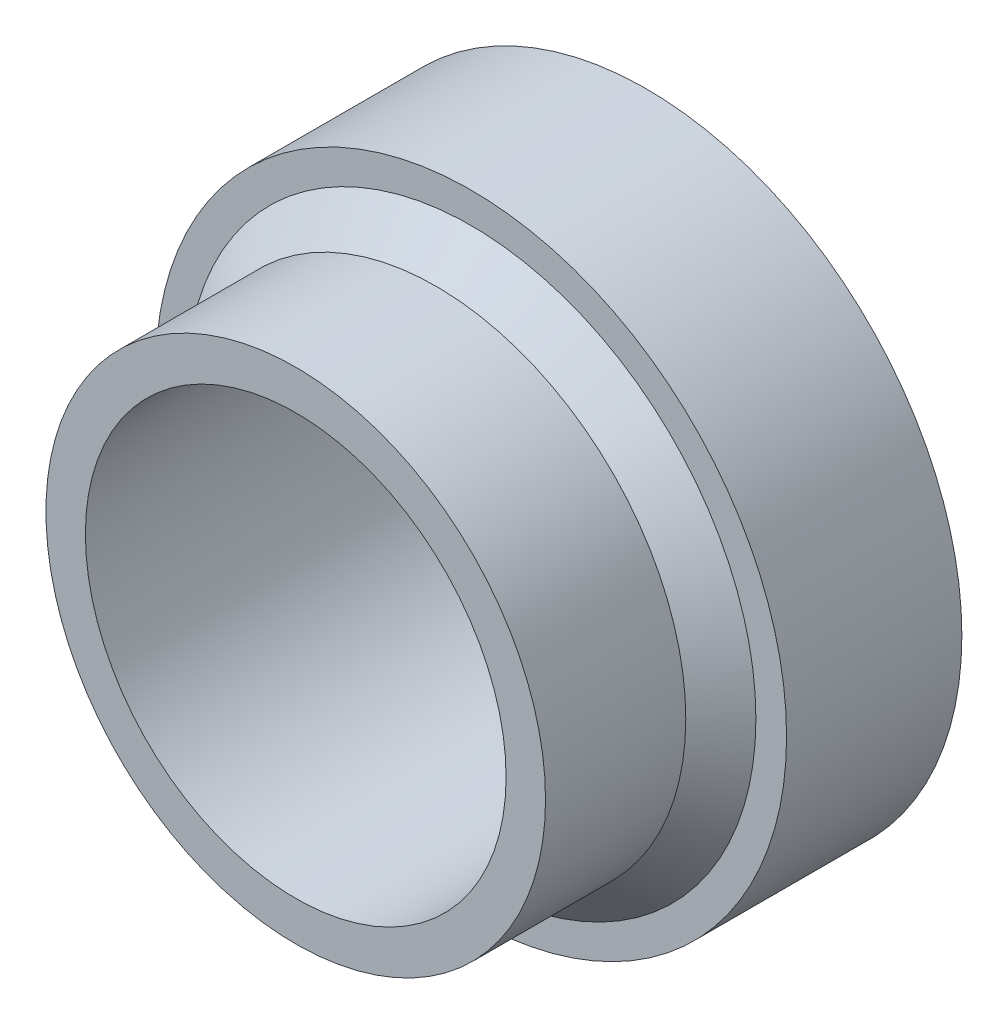
ISO-10303-21;
HEADER;
FILE_DESCRIPTION(('STEP AP214'),'2;1');
FILE_NAME('part.step','',(''),(''),'','','');
FILE_SCHEMA(('AUTOMOTIVE_DESIGN { 1 0 10303 214 1 1 1 1 }'));
ENDSEC;
DATA;
#1=APPLICATION_CONTEXT('core data for automotive mechanical design processes');
#2=APPLICATION_PROTOCOL_DEFINITION('international standard','automotive_design',2000,#1);
#3=PRODUCT_CONTEXT('',#1,'mechanical');
#4=PRODUCT('Part','Part','',(#3));
#5=PRODUCT_RELATED_PRODUCT_CATEGORY('part','',(#4));
#6=PRODUCT_DEFINITION_FORMATION('','',#4);
#7=PRODUCT_DEFINITION_CONTEXT('part definition',#1,'design');
#8=PRODUCT_DEFINITION('design','',#6,#7);
#9=PRODUCT_DEFINITION_SHAPE('','',#8);
#10=(LENGTH_UNIT() NAMED_UNIT(*) SI_UNIT(.MILLI.,.METRE.));
#11=(NAMED_UNIT(*) PLANE_ANGLE_UNIT() SI_UNIT($,.RADIAN.));
#12=(NAMED_UNIT(*) SI_UNIT($,.STERADIAN.) SOLID_ANGLE_UNIT());
#13=UNCERTAINTY_MEASURE_WITH_UNIT(LENGTH_MEASURE(1.E-05),#10,'distance_accuracy_value','');
#14=(GEOMETRIC_REPRESENTATION_CONTEXT(3) GLOBAL_UNCERTAINTY_ASSIGNED_CONTEXT((#13)) GLOBAL_UNIT_ASSIGNED_CONTEXT((#10,
#11,#12)) REPRESENTATION_CONTEXT('',''));
#15=CARTESIAN_POINT('',(0.,0.,0.));
#16=DIRECTION('',(0.,0.,1.));
#17=DIRECTION('',(1.,0.,0.));
#18=AXIS2_PLACEMENT_3D('',#15,#16,#17);
#19=CARTESIAN_POINT('',(0.,0.,10.));
#20=DIRECTION('',(0.,0.,1.));
#21=DIRECTION('',(1.,0.,0.));
#22=AXIS2_PLACEMENT_3D('',#19,#20,#21);
#23=PLANE('',#22);
#24=CARTESIAN_POINT('',(0.,0.,10.));
#25=DIRECTION('',(0.,0.,1.));
#26=DIRECTION('',(1.,0.,0.));
#27=AXIS2_PLACEMENT_3D('',#24,#25,#26);
#28=CIRCLE('',#27,16.25);
#29=CARTESIAN_POINT('',(16.25,0.,10.));
#30=VERTEX_POINT('',#29);
#31=EDGE_CURVE('E10',#30,#30,#28,.F.);
#32=ORIENTED_EDGE('',*,*,#31,.T.);
#33=EDGE_LOOP('',(#32));
#34=FACE_BOUND('',#33,.T.);
#35=CARTESIAN_POINT('',(0.,0.,10.));
#36=DIRECTION('',(0.,0.,1.));
#37=DIRECTION('',(1.,0.,0.));
#38=AXIS2_PLACEMENT_3D('',#35,#36,#37);
#39=CIRCLE('',#38,18.);
#40=CARTESIAN_POINT('',(18.,0.,10.));
#41=VERTEX_POINT('',#40);
#42=EDGE_CURVE('E44',#41,#41,#39,.T.);
#43=ORIENTED_EDGE('',*,*,#42,.T.);
#44=EDGE_LOOP('',(#43));
#45=FACE_BOUND('',#44,.T.);
#46=ADVANCED_FACE('F33',(#34,#45),#23,.T.);
#47=CARTESIAN_POINT('',(0.,0.,0.));
#48=DIRECTION('',(0.,0.,1.));
#49=DIRECTION('',(1.,0.,0.));
#50=AXIS2_PLACEMENT_3D('',#47,#48,#49);
#51=PLANE('',#50);
#52=CARTESIAN_POINT('',(0.,0.,0.));
#53=DIRECTION('',(0.,0.,1.));
#54=DIRECTION('',(1.,0.,0.));
#55=AXIS2_PLACEMENT_3D('',#52,#53,#54);
#56=CIRCLE('',#55,18.);
#57=CARTESIAN_POINT('',(18.,0.,0.));
#58=VERTEX_POINT('',#57);
#59=EDGE_CURVE('E48',#58,#58,#56,.T.);
#60=ORIENTED_EDGE('',*,*,#59,.F.);
#61=EDGE_LOOP('',(#60));
#62=FACE_BOUND('',#61,.T.);
#63=CARTESIAN_POINT('',(0.,0.,0.));
#64=DIRECTION('',(0.,0.,1.));
#65=DIRECTION('',(1.,0.,0.));
#66=AXIS2_PLACEMENT_3D('',#63,#64,#65);
#67=CIRCLE('',#66,14.2);
#68=CARTESIAN_POINT('',(14.2,0.,0.));
#69=VERTEX_POINT('',#68);
#70=EDGE_CURVE('E57',#69,#69,#67,.T.);
#71=ORIENTED_EDGE('',*,*,#70,.T.);
#72=EDGE_LOOP('',(#71));
#73=FACE_BOUND('',#72,.T.);
#74=ADVANCED_FACE('F86',(#62,#73),#51,.F.);
#75=CARTESIAN_POINT('',(0.,0.,10.));
#76=DIRECTION('',(0.,0.,-1.));
#77=DIRECTION('',(-1.,0.,0.));
#78=AXIS2_PLACEMENT_3D('',#75,#76,#77);
#79=CYLINDRICAL_SURFACE('',#78,18.);
#80=ORIENTED_EDGE('',*,*,#42,.F.);
#81=EDGE_LOOP('',(#80));
#82=FACE_BOUND('',#81,.T.);
#83=ORIENTED_EDGE('',*,*,#59,.T.);
#84=EDGE_LOOP('',(#83));
#85=FACE_BOUND('',#84,.T.);
#86=ADVANCED_FACE('F91',(#82,#85),#79,.T.);
#87=CARTESIAN_POINT('',(0.,0.,10.));
#88=DIRECTION('',(0.,0.,-1.));
#89=DIRECTION('',(-1.,0.,0.));
#90=AXIS2_PLACEMENT_3D('',#87,#88,#89);
#91=CYLINDRICAL_SURFACE('',#90,12.);
#92=CARTESIAN_POINT('',(0.,0.,1.75));
#93=DIRECTION('',(0.,0.,1.));
#94=DIRECTION('',(1.,0.,0.));
#95=AXIS2_PLACEMENT_3D('',#92,#93,#94);
#96=CIRCLE('',#95,12.);
#97=CARTESIAN_POINT('',(12.,0.,1.75));
#98=VERTEX_POINT('',#97);
#99=EDGE_CURVE('E51',#98,#98,#96,.T.);
#100=ORIENTED_EDGE('',*,*,#99,.F.);
#101=EDGE_LOOP('',(#100));
#102=FACE_BOUND('',#101,.T.);
#103=CARTESIAN_POINT('',(0.,0.,20.));
#104=DIRECTION('',(0.,0.,1.));
#105=DIRECTION('',(1.,0.,0.));
#106=AXIS2_PLACEMENT_3D('',#103,#104,#105);
#107=CIRCLE('',#106,12.);
#108=CARTESIAN_POINT('',(12.,0.,20.));
#109=VERTEX_POINT('',#108);
#110=EDGE_CURVE('E65',#109,#109,#107,.T.);
#111=ORIENTED_EDGE('',*,*,#110,.T.);
#112=EDGE_LOOP('',(#111));
#113=FACE_BOUND('',#112,.T.);
#114=ADVANCED_FACE('F69',(#102,#113),#91,.F.);
#115=CARTESIAN_POINT('',(0.,0.,1.75));
#116=DIRECTION('',(0.,0.,-1.));
#117=DIRECTION('',(-1.,0.,0.));
#118=AXIS2_PLACEMENT_3D('',#115,#116,#117);
#119=CYLINDRICAL_SURFACE('',#118,14.2);
#120=CARTESIAN_POINT('',(0.,0.,1.75));
#121=DIRECTION('',(0.,0.,1.));
#122=DIRECTION('',(1.,0.,0.));
#123=AXIS2_PLACEMENT_3D('',#120,#121,#122);
#124=CIRCLE('',#123,14.2);
#125=CARTESIAN_POINT('',(14.2,0.,1.75));
#126=VERTEX_POINT('',#125);
#127=EDGE_CURVE('E54',#126,#126,#124,.T.);
#128=ORIENTED_EDGE('',*,*,#127,.T.);
#129=EDGE_LOOP('',(#128));
#130=FACE_BOUND('',#129,.T.);
#131=ORIENTED_EDGE('',*,*,#70,.F.);
#132=EDGE_LOOP('',(#131));
#133=FACE_BOUND('',#132,.T.);
#134=ADVANCED_FACE('F82',(#130,#133),#119,.F.);
#135=CARTESIAN_POINT('',(0.,0.,1.75));
#136=DIRECTION('',(0.,0.,1.));
#137=DIRECTION('',(1.,0.,0.));
#138=AXIS2_PLACEMENT_3D('',#135,#136,#137);
#139=PLANE('',#138);
#140=ORIENTED_EDGE('',*,*,#99,.T.);
#141=EDGE_LOOP('',(#140));
#142=FACE_BOUND('',#141,.T.);
#143=ORIENTED_EDGE('',*,*,#127,.F.);
#144=EDGE_LOOP('',(#143));
#145=FACE_BOUND('',#144,.T.);
#146=ADVANCED_FACE('F74',(#142,#145),#139,.F.);
#147=CARTESIAN_POINT('',(0.,0.,20.));
#148=DIRECTION('',(0.,0.,1.));
#149=DIRECTION('',(1.,0.,0.));
#150=AXIS2_PLACEMENT_3D('',#147,#148,#149);
#151=PLANE('',#150);
#152=CARTESIAN_POINT('',(0.,0.,20.));
#153=DIRECTION('',(0.,0.,1.));
#154=DIRECTION('',(1.,0.,0.));
#155=AXIS2_PLACEMENT_3D('',#152,#153,#154);
#156=CIRCLE('',#155,14.25);
#157=CARTESIAN_POINT('',(14.25,0.,20.));
#158=VERTEX_POINT('',#157);
#159=EDGE_CURVE('E60',#158,#158,#156,.T.);
#160=ORIENTED_EDGE('',*,*,#159,.T.);
#161=EDGE_LOOP('',(#160));
#162=FACE_BOUND('',#161,.T.);
#163=ORIENTED_EDGE('',*,*,#110,.F.);
#164=EDGE_LOOP('',(#163));
#165=FACE_BOUND('',#164,.T.);
#166=ADVANCED_FACE('F71',(#162,#165),#151,.T.);
#167=CARTESIAN_POINT('',(0.,0.,20.));
#168=DIRECTION('',(0.,0.,-1.));
#169=DIRECTION('',(-1.,0.,0.));
#170=AXIS2_PLACEMENT_3D('',#167,#168,#169);
#171=CYLINDRICAL_SURFACE('',#170,14.25);
#172=CARTESIAN_POINT('',(0.,0.,12.));
#173=DIRECTION('',(0.,0.,1.));
#174=DIRECTION('',(1.,0.,0.));
#175=AXIS2_PLACEMENT_3D('',#172,#173,#174);
#176=CIRCLE('',#175,14.25);
#177=CARTESIAN_POINT('',(14.25,0.,12.));
#178=VERTEX_POINT('',#177);
#179=EDGE_CURVE('E40',#178,#178,#176,.T.);
#180=ORIENTED_EDGE('',*,*,#179,.T.);
#181=EDGE_LOOP('',(#180));
#182=FACE_BOUND('',#181,.T.);
#183=ORIENTED_EDGE('',*,*,#159,.F.);
#184=EDGE_LOOP('',(#183));
#185=FACE_BOUND('',#184,.T.);
#186=ADVANCED_FACE('F73',(#182,#185),#171,.T.);
#187=CARTESIAN_POINT('',(0.,0.,12.));
#188=DIRECTION('',(0.,0.,-1.));
#189=DIRECTION('',(-1.,0.,0.));
#190=AXIS2_PLACEMENT_3D('',#187,#188,#189);
#191=CONICAL_SURFACE('',#190,14.25,0.785398163397443);
#192=ORIENTED_EDGE('',*,*,#31,.F.);
#193=EDGE_LOOP('',(#192));
#194=FACE_BOUND('',#193,.T.);
#195=ORIENTED_EDGE('',*,*,#179,.F.);
#196=EDGE_LOOP('',(#195));
#197=FACE_BOUND('',#196,.T.);
#198=ADVANCED_FACE('F35',(#194,#197),#191,.T.);
#199=CLOSED_SHELL('',(#46,#74,#86,#114,#134,#146,#166,#186,#198));
#200=MANIFOLD_SOLID_BREP('B2',#199);
#201=ADVANCED_BREP_SHAPE_REPRESENTATION('',(#18,#200),#14);
#202=SHAPE_DEFINITION_REPRESENTATION(#9,#201);
ENDSEC;
END-ISO-10303-21;
